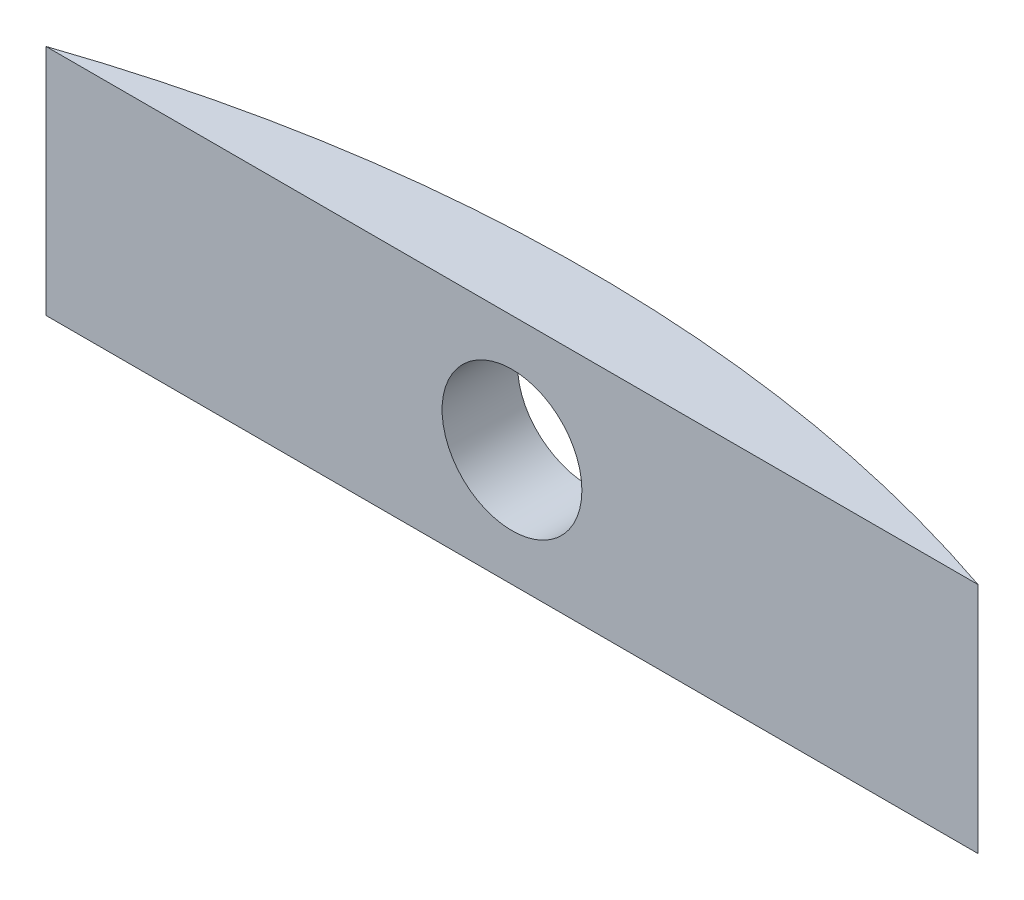
ISO-10303-21;
HEADER;
FILE_DESCRIPTION(('STEP AP214'),'2;1');
FILE_NAME('part.step','',(''),(''),'','','');
FILE_SCHEMA(('AUTOMOTIVE_DESIGN { 1 0 10303 214 1 1 1 1 }'));
ENDSEC;
DATA;
#1=APPLICATION_CONTEXT('core data for automotive mechanical design processes');
#2=APPLICATION_PROTOCOL_DEFINITION('international standard','automotive_design',2000,#1);
#3=PRODUCT_CONTEXT('',#1,'mechanical');
#4=PRODUCT('Part','Part','',(#3));
#5=PRODUCT_RELATED_PRODUCT_CATEGORY('part','',(#4));
#6=PRODUCT_DEFINITION_FORMATION('','',#4);
#7=PRODUCT_DEFINITION_CONTEXT('part definition',#1,'design');
#8=PRODUCT_DEFINITION('design','',#6,#7);
#9=PRODUCT_DEFINITION_SHAPE('','',#8);
#10=(LENGTH_UNIT() NAMED_UNIT(*) SI_UNIT(.MILLI.,.METRE.));
#11=(NAMED_UNIT(*) PLANE_ANGLE_UNIT() SI_UNIT($,.RADIAN.));
#12=(NAMED_UNIT(*) SI_UNIT($,.STERADIAN.) SOLID_ANGLE_UNIT());
#13=UNCERTAINTY_MEASURE_WITH_UNIT(LENGTH_MEASURE(1.E-05),#10,'distance_accuracy_value','');
#14=(GEOMETRIC_REPRESENTATION_CONTEXT(3) GLOBAL_UNCERTAINTY_ASSIGNED_CONTEXT((#13)) GLOBAL_UNIT_ASSIGNED_CONTEXT((#10,
#11,#12)) REPRESENTATION_CONTEXT('',''));
#15=CARTESIAN_POINT('',(0.,0.,0.));
#16=DIRECTION('',(0.,0.,1.));
#17=DIRECTION('',(1.,0.,0.));
#18=AXIS2_PLACEMENT_3D('',#15,#16,#17);
#19=CARTESIAN_POINT('',(20.,10.,58.6856030044848));
#20=DIRECTION('',(0.,-1.,0.));
#21=DIRECTION('',(0.,0.,-1.));
#22=AXIS2_PLACEMENT_3D('',#19,#20,#21);
#23=CYLINDRICAL_SURFACE('',#22,62.);
#24=CARTESIAN_POINT('',(23.,5.,-3.2417738170793));
#25=CARTESIAN_POINT('',(22.9999925652252,5.16840545455049,-3.24177479307991));
#26=CARTESIAN_POINT('',(22.9857721776498,5.33693050802542,-3.24246814341645));
#27=CARTESIAN_POINT('',(22.9292456336218,5.66933208370256,-3.24516713272505));
#28=CARTESIAN_POINT('',(22.8869063398127,5.83320288311438,-3.24717431997747));
#29=CARTESIAN_POINT('',(22.7753566205002,6.15143264720901,-3.25227308898608));
#30=CARTESIAN_POINT('',(22.706159838389,6.30579639534057,-3.25536412008126));
#31=CARTESIAN_POINT('',(22.5428801965622,6.60067547115842,-3.26228158380704));
#32=CARTESIAN_POINT('',(22.4488032310017,6.74119406797563,-3.26610784220249));
#33=CARTESIAN_POINT('',(22.2383331818213,7.00457050881941,-3.27406880675786));
#34=CARTESIAN_POINT('',(22.1219215019822,7.12741348564987,-3.27820376818358));
#35=CARTESIAN_POINT('',(21.8701234535908,7.35182496220875,-3.28631379396743));
#36=CARTESIAN_POINT('',(21.7347363127831,7.45339259566208,-3.29028885180939));
#37=CARTESIAN_POINT('',(21.4487539642509,7.63241015925849,-3.29763303882797));
#38=CARTESIAN_POINT('',(21.2981515981649,7.70984866665369,-3.3010018807036));
#39=CARTESIAN_POINT('',(20.9860642817648,7.8383364252374,-3.30675144544857));
#40=CARTESIAN_POINT('',(20.8245794099719,7.88938586680981,-3.30913217544663));
#41=CARTESIAN_POINT('',(20.4954463906827,7.96360754711532,-3.31263553557173));
#42=CARTESIAN_POINT('',(20.3278032179026,7.98680179839736,-3.3137591590784));
#43=CARTESIAN_POINT('',(19.9909993776118,8.00472262407629,-3.3146250123444));
#44=CARTESIAN_POINT('',(19.8218387214689,7.99944941155386,-3.31436725244348));
#45=CARTESIAN_POINT('',(19.4869508168246,7.96060328259404,-3.31250022403662));
#46=CARTESIAN_POINT('',(19.3212208123676,7.92705406301163,-3.31089208722526));
#47=CARTESIAN_POINT('',(18.9977477035245,7.83264498723744,-3.3065067558356));
#48=CARTESIAN_POINT('',(18.8400046310616,7.7717850218962,-3.30372955658506));
#49=CARTESIAN_POINT('',(18.5369068186995,7.62445500823565,-3.2973170012375));
#50=CARTESIAN_POINT('',(18.3915573380007,7.53797415670127,-3.29368128327191));
#51=CARTESIAN_POINT('',(18.1174301421806,7.34186514254563,-3.28596115826708));
#52=CARTESIAN_POINT('',(17.9886525362513,7.23223682741831,-3.28187674827172));
#53=CARTESIAN_POINT('',(17.7511864181789,6.99281085220975,-3.27371429630452));
#54=CARTESIAN_POINT('',(17.6425186329797,6.86299263340886,-3.26963626515132));
#55=CARTESIAN_POINT('',(17.4485164961826,6.5869441626617,-3.26195052703118));
#56=CARTESIAN_POINT('',(17.363182150496,6.44071390655751,-3.2583428201834));
#57=CARTESIAN_POINT('',(17.218271072965,6.13597987239024,-3.25200488580513));
#58=CARTESIAN_POINT('',(17.1586951099046,5.97747572816742,-3.24927468446527));
#59=CARTESIAN_POINT('',(17.0670057337076,5.6526988798258,-3.24500065344386));
#60=CARTESIAN_POINT('',(17.0348921271259,5.48642623043711,-3.24345681540556));
#61=CARTESIAN_POINT('',(16.9990646660473,5.15101277313086,-3.24173115042209));
#62=CARTESIAN_POINT('',(16.9953220485207,4.98187504433989,-3.24154794404737));
#63=CARTESIAN_POINT('',(17.016267754508,4.645373949208,-3.2425606013377));
#64=CARTESIAN_POINT('',(17.0409559900719,4.47801057737976,-3.24375646073665));
#65=CARTESIAN_POINT('',(17.1180387417377,4.14988976768982,-3.24739120352356));
#66=CARTESIAN_POINT('',(17.1704201018781,3.98912923211716,-3.24982949665812));
#67=CARTESIAN_POINT('',(17.301388872685,3.67868209921064,-3.25567378236789));
#68=CARTESIAN_POINT('',(17.3799764252436,3.52899556184175,-3.25907978018268));
#69=CARTESIAN_POINT('',(17.5612006221951,3.24481313058312,-3.26647893975282));
#70=CARTESIAN_POINT('',(17.6638565927254,3.1103295734799,-3.27047257239459));
#71=CARTESIAN_POINT('',(17.8902753512799,2.8604946759863,-3.27859521292288));
#72=CARTESIAN_POINT('',(18.0140382661787,2.74514345060929,-3.28272422162303));
#73=CARTESIAN_POINT('',(18.2792812455999,2.53675102097814,-3.29065625754158));
#74=CARTESIAN_POINT('',(18.420775913633,2.44372839235309,-3.29445901166378));
#75=CARTESIAN_POINT('',(18.7173920155801,2.28276070895538,-3.30130605315108));
#76=CARTESIAN_POINT('',(18.8725133929984,2.21481555021894,-3.30435034366054));
#77=CARTESIAN_POINT('',(19.1919103937169,2.10596401663846,-3.30933605263865));
#78=CARTESIAN_POINT('',(19.3561819542313,2.06504574369571,-3.31127795636021));
#79=CARTESIAN_POINT('',(19.6892731938254,2.01137053311503,-3.31384196462223));
#80=CARTESIAN_POINT('',(19.8580928493912,1.99861344991078,-3.31446407598475));
#81=CARTESIAN_POINT('',(20.1953036575139,2.00162415127406,-3.31431841843308));
#82=CARTESIAN_POINT('',(20.3636950716939,2.01736278907415,-3.31355206970082));
#83=CARTESIAN_POINT('',(20.6954419503584,2.07685794240264,-3.31071856773693));
#84=CARTESIAN_POINT('',(20.8587974052972,2.12061451103572,-3.30865141203978));
#85=CARTESIAN_POINT('',(21.1758416656937,2.23489757146406,-3.3034488901677));
#86=CARTESIAN_POINT('',(21.3295303878906,2.30542429379714,-3.30031351479357));
#87=CARTESIAN_POINT('',(21.6228869916938,2.47124040998033,-3.29332723381535));
#88=CARTESIAN_POINT('',(21.7625553110793,2.56652903032068,-3.2894763505633));
#89=CARTESIAN_POINT('',(22.0240515777955,2.77926767638109,-3.28148806015874));
#90=CARTESIAN_POINT('',(22.1458631104441,2.89673786818433,-3.27735039446544));
#91=CARTESIAN_POINT('',(22.3680741732913,3.150494721759,-3.2692565623347));
#92=CARTESIAN_POINT('',(22.4684684246663,3.28678600885446,-3.2653004408315));
#93=CARTESIAN_POINT('',(22.6450392014587,3.57441807469796,-3.25801336368009));
#94=CARTESIAN_POINT('',(22.7211931537232,3.72577270966933,-3.2546829919205));
#95=CARTESIAN_POINT('',(22.8469176258246,4.03902205156212,-3.2490323613081));
#96=CARTESIAN_POINT('',(22.8965195753278,4.20090404141695,-3.24671090881058));
#97=CARTESIAN_POINT('',(22.9547079226321,4.4698279269837,-3.24395515005596));
#98=CARTESIAN_POINT('',(22.9716707984718,4.57512756573901,-3.24314075240813));
#99=CARTESIAN_POINT('',(22.9943191847753,4.78693550963932,-3.24204977735931));
#100=CARTESIAN_POINT('',(23.0000047042493,4.89344381381856,-3.24177319952863));
#101=CARTESIAN_POINT('',(23.,5.,-3.2417738170793));
#102=B_SPLINE_CURVE_WITH_KNOTS('',3,(#24,#25,#26,#27,#28,#29,#30,#31,#32,#33,#34,#35,#36,#37,
#38,#39,#40,#41,#42,#43,#44,#45,#46,#47,#48,#49,#50,#51,#52,#53,#54,#55,#56,#57,#58,#59,#60,#61,
#62,#63,#64,#65,#66,#67,#68,#69,#70,#71,#72,#73,#74,#75,#76,#77,#78,#79,#80,#81,#82,#83,#84,#85,
#86,#87,#88,#89,#90,#91,#92,#93,#94,#95,#96,#97,#98,#99,#100,#101),.UNSPECIFIED.,.T.,.F.,(4,2,2,
2,2,2,2,2,2,2,2,2,2,2,2,2,2,2,2,2,2,2,2,2,2,2,2,2,2,2,2,2,2,2,2,2,2,2,4),(0.,0.504827395251811,
1.0102507738607,1.5154177367126,2.02046513173993,2.52593487617819,3.03142519799405,
3.5371544570418,4.04288006745528,4.54820576494865,5.05352768005421,5.55842652810592,
6.06332739404196,6.56844145848866,7.07355885096129,7.5791939968486,8.08482927083672,
8.59047963496195,9.09612643725329,9.60126053688219,10.1063930738961,10.6112858567933,
11.1161813734524,11.621483701301,12.1267890666478,12.6325133604028,13.1382355575507,
13.6437349709771,14.1492317714505,14.6542118180207,15.1591928217239,15.6641781742949,
16.1691477540784,16.6745786501229,17.1801339786604,17.686158724502,18.1915831556989,
18.5110058551579,18.8304282994102),.UNSPECIFIED.);
#103=CARTESIAN_POINT('',(23.,5.,-3.2417738170793));
#104=VERTEX_POINT('',#103);
#105=EDGE_CURVE('E70',#104,#104,#102,.T.);
#106=ORIENTED_EDGE('',*,*,#105,.T.);
#107=EDGE_LOOP('',(#106));
#108=FACE_BOUND('',#107,.T.);
#109=CARTESIAN_POINT('',(20.,0.,58.6856030044848));
#110=DIRECTION('',(0.,-1.,0.));
#111=DIRECTION('',(0.,0.,-1.));
#112=AXIS2_PLACEMENT_3D('',#109,#110,#111);
#113=CIRCLE('',#112,62.);
#114=CARTESIAN_POINT('',(0.,0.,0.));
#115=VERTEX_POINT('',#114);
#116=CARTESIAN_POINT('',(40.,0.,0.));
#117=VERTEX_POINT('',#116);
#118=EDGE_CURVE('E64',#115,#117,#113,.T.);
#119=ORIENTED_EDGE('',*,*,#118,.F.);
#120=DIRECTION('',(0.,-1.,0.));
#121=VECTOR('',#120,1.);
#122=CARTESIAN_POINT('',(0.,10.,0.));
#123=LINE('',#122,#121);
#124=CARTESIAN_POINT('',(0.,10.,0.));
#125=VERTEX_POINT('',#124);
#126=EDGE_CURVE('E11',#125,#115,#123,.T.);
#127=ORIENTED_EDGE('',*,*,#126,.F.);
#128=CARTESIAN_POINT('',(20.,10.,58.6856030044848));
#129=DIRECTION('',(0.,-1.,0.));
#130=DIRECTION('',(0.,0.,-1.));
#131=AXIS2_PLACEMENT_3D('',#128,#129,#130);
#132=CIRCLE('',#131,62.);
#133=CARTESIAN_POINT('',(40.,10.,0.));
#134=VERTEX_POINT('',#133);
#135=EDGE_CURVE('E65',#125,#134,#132,.T.);
#136=ORIENTED_EDGE('',*,*,#135,.T.);
#137=DIRECTION('',(0.,-1.,0.));
#138=VECTOR('',#137,1.);
#139=CARTESIAN_POINT('',(40.,10.,0.));
#140=LINE('',#139,#138);
#141=EDGE_CURVE('E36',#134,#117,#140,.T.);
#142=ORIENTED_EDGE('',*,*,#141,.T.);
#143=EDGE_LOOP('',(#119,#127,#136,#142));
#144=FACE_BOUND('',#143,.T.);
#145=ADVANCED_FACE('F33',(#108,#144),#23,.T.);
#146=CARTESIAN_POINT('',(0.,10.,0.));
#147=DIRECTION('',(0.,0.,-1.));
#148=DIRECTION('',(-1.,0.,0.));
#149=AXIS2_PLACEMENT_3D('',#146,#147,#148);
#150=PLANE('',#149);
#151=CARTESIAN_POINT('',(20.,5.,0.));
#152=DIRECTION('',(0.,0.,1.));
#153=DIRECTION('',(1.,0.,0.));
#154=AXIS2_PLACEMENT_3D('',#151,#152,#153);
#155=CIRCLE('',#154,3.);
#156=CARTESIAN_POINT('',(23.,5.,0.));
#157=VERTEX_POINT('',#156);
#158=EDGE_CURVE('E67',#157,#157,#155,.T.);
#159=ORIENTED_EDGE('',*,*,#158,.F.);
#160=EDGE_LOOP('',(#159));
#161=FACE_BOUND('',#160,.T.);
#162=DIRECTION('',(1.,0.,0.));
#163=VECTOR('',#162,1.);
#164=CARTESIAN_POINT('',(0.,0.,0.));
#165=LINE('',#164,#163);
#166=EDGE_CURVE('E58',#115,#117,#165,.T.);
#167=ORIENTED_EDGE('',*,*,#166,.T.);
#168=ORIENTED_EDGE('',*,*,#141,.F.);
#169=DIRECTION('',(1.,0.,0.));
#170=VECTOR('',#169,1.);
#171=CARTESIAN_POINT('',(0.,10.,0.));
#172=LINE('',#171,#170);
#173=EDGE_CURVE('E60',#125,#134,#172,.T.);
#174=ORIENTED_EDGE('',*,*,#173,.F.);
#175=ORIENTED_EDGE('',*,*,#126,.T.);
#176=EDGE_LOOP('',(#167,#168,#174,#175));
#177=FACE_BOUND('',#176,.T.);
#178=ADVANCED_FACE('F57',(#161,#177),#150,.F.);
#179=CARTESIAN_POINT('',(20.,10.,58.6856030044848));
#180=DIRECTION('',(0.,-1.,0.));
#181=DIRECTION('',(0.,0.,-1.));
#182=AXIS2_PLACEMENT_3D('',#179,#180,#181);
#183=PLANE('',#182);
#184=ORIENTED_EDGE('',*,*,#135,.F.);
#185=ORIENTED_EDGE('',*,*,#173,.T.);
#186=EDGE_LOOP('',(#184,#185));
#187=FACE_BOUND('',#186,.T.);
#188=ADVANCED_FACE('F86',(#187),#183,.F.);
#189=CARTESIAN_POINT('',(20.,0.,58.6856030044848));
#190=DIRECTION('',(0.,-1.,0.));
#191=DIRECTION('',(0.,0.,-1.));
#192=AXIS2_PLACEMENT_3D('',#189,#190,#191);
#193=PLANE('',#192);
#194=ORIENTED_EDGE('',*,*,#118,.T.);
#195=ORIENTED_EDGE('',*,*,#166,.F.);
#196=EDGE_LOOP('',(#194,#195));
#197=FACE_BOUND('',#196,.T.);
#198=ADVANCED_FACE('F63',(#197),#193,.T.);
#199=CARTESIAN_POINT('',(20.,5.,-3.31539699551516));
#200=DIRECTION('',(0.,0.,1.));
#201=DIRECTION('',(1.,0.,0.));
#202=AXIS2_PLACEMENT_3D('',#199,#200,#201);
#203=CYLINDRICAL_SURFACE('',#202,3.);
#204=ORIENTED_EDGE('',*,*,#105,.F.);
#205=EDGE_LOOP('',(#204));
#206=FACE_BOUND('',#205,.T.);
#207=ORIENTED_EDGE('',*,*,#158,.T.);
#208=EDGE_LOOP('',(#207));
#209=FACE_BOUND('',#208,.T.);
#210=ADVANCED_FACE('F80',(#206,#209),#203,.F.);
#211=CLOSED_SHELL('',(#145,#178,#188,#198,#210));
#212=MANIFOLD_SOLID_BREP('B2',#211);
#213=ADVANCED_BREP_SHAPE_REPRESENTATION('',(#18,#212),#14);
#214=SHAPE_DEFINITION_REPRESENTATION(#9,#213);
ENDSEC;
END-ISO-10303-21;
